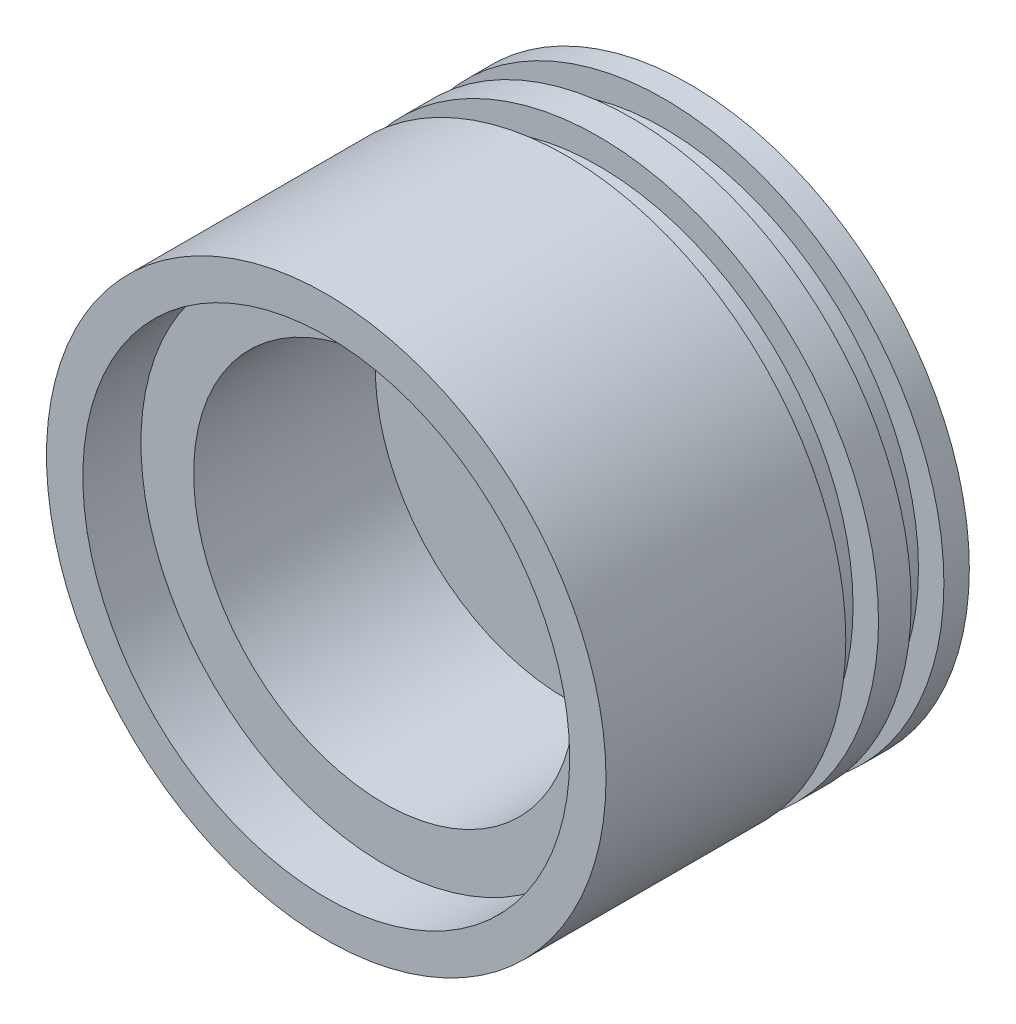
ISO-10303-21;
HEADER;
FILE_DESCRIPTION(('STEP AP214'),'2;1');
FILE_NAME('part.step','',(''),(''),'','','');
FILE_SCHEMA(('AUTOMOTIVE_DESIGN { 1 0 10303 214 1 1 1 1 }'));
ENDSEC;
DATA;
#1=APPLICATION_CONTEXT('core data for automotive mechanical design processes');
#2=APPLICATION_PROTOCOL_DEFINITION('international standard','automotive_design',2000,#1);
#3=PRODUCT_CONTEXT('',#1,'mechanical');
#4=PRODUCT('Part','Part','',(#3));
#5=PRODUCT_RELATED_PRODUCT_CATEGORY('part','',(#4));
#6=PRODUCT_DEFINITION_FORMATION('','',#4);
#7=PRODUCT_DEFINITION_CONTEXT('part definition',#1,'design');
#8=PRODUCT_DEFINITION('design','',#6,#7);
#9=PRODUCT_DEFINITION_SHAPE('','',#8);
#10=(LENGTH_UNIT() NAMED_UNIT(*) SI_UNIT(.MILLI.,.METRE.));
#11=(NAMED_UNIT(*) PLANE_ANGLE_UNIT() SI_UNIT($,.RADIAN.));
#12=(NAMED_UNIT(*) SI_UNIT($,.STERADIAN.) SOLID_ANGLE_UNIT());
#13=UNCERTAINTY_MEASURE_WITH_UNIT(LENGTH_MEASURE(1.E-05),#10,'distance_accuracy_value','');
#14=(GEOMETRIC_REPRESENTATION_CONTEXT(3) GLOBAL_UNCERTAINTY_ASSIGNED_CONTEXT((#13)) GLOBAL_UNIT_ASSIGNED_CONTEXT((#10,
#11,#12)) REPRESENTATION_CONTEXT('',''));
#15=CARTESIAN_POINT('',(0.,0.,0.));
#16=DIRECTION('',(0.,0.,1.));
#17=DIRECTION('',(1.,0.,0.));
#18=AXIS2_PLACEMENT_3D('',#15,#16,#17);
#19=CARTESIAN_POINT('',(0.,0.,-66.));
#20=DIRECTION('',(0.,0.,1.));
#21=DIRECTION('',(1.,0.,0.));
#22=AXIS2_PLACEMENT_3D('',#19,#20,#21);
#23=PLANE('',#22);
#24=CARTESIAN_POINT('',(0.,0.,-66.));
#25=DIRECTION('',(0.,0.,1.));
#26=DIRECTION('',(1.,0.,0.));
#27=AXIS2_PLACEMENT_3D('',#24,#25,#26);
#28=CIRCLE('',#27,52.5);
#29=CARTESIAN_POINT('',(52.5,0.,-66.));
#30=VERTEX_POINT('',#29);
#31=EDGE_CURVE('E77',#30,#30,#28,.T.);
#32=ORIENTED_EDGE('',*,*,#31,.T.);
#33=EDGE_LOOP('',(#32));
#34=FACE_BOUND('',#33,.T.);
#35=ADVANCED_FACE('F31',(#34),#23,.T.);
#36=CARTESIAN_POINT('',(0.,0.,191.45));
#37=DIRECTION('',(0.,0.,1.));
#38=DIRECTION('',(1.,0.,0.));
#39=AXIS2_PLACEMENT_3D('',#36,#37,#38);
#40=SPHERICAL_SURFACE('',#39,301.45);
#41=CARTESIAN_POINT('',(0.,0.,-100.));
#42=DIRECTION('',(0.,0.,1.));
#43=DIRECTION('',(1.,0.,0.));
#44=AXIS2_PLACEMENT_3D('',#41,#42,#43);
#45=CIRCLE('',#44,77.);
#46=CARTESIAN_POINT('',(77.,0.,-100.));
#47=VERTEX_POINT('',#46);
#48=EDGE_CURVE('E10',#47,#47,#45,.T.);
#49=ORIENTED_EDGE('',*,*,#48,.F.);
#50=EDGE_LOOP('',(#49));
#51=FACE_BOUND('',#50,.T.);
#52=ADVANCED_FACE('F94',(#51),#40,.T.);
#53=CARTESIAN_POINT('',(0.,0.,14.193325572744));
#54=DIRECTION('',(0.,0.,1.));
#55=DIRECTION('',(1.,0.,0.));
#56=AXIS2_PLACEMENT_3D('',#53,#54,#55);
#57=CYLINDRICAL_SURFACE('',#56,77.);
#58=ORIENTED_EDGE('',*,*,#48,.T.);
#59=EDGE_LOOP('',(#58));
#60=FACE_BOUND('',#59,.T.);
#61=CARTESIAN_POINT('',(0.,0.,-93.));
#62=DIRECTION('',(0.,0.,1.));
#63=DIRECTION('',(1.,0.,0.));
#64=AXIS2_PLACEMENT_3D('',#61,#62,#63);
#65=CIRCLE('',#64,77.);
#66=CARTESIAN_POINT('',(77.,0.,-93.));
#67=VERTEX_POINT('',#66);
#68=EDGE_CURVE('E37',#67,#67,#65,.T.);
#69=ORIENTED_EDGE('',*,*,#68,.F.);
#70=EDGE_LOOP('',(#69));
#71=FACE_BOUND('',#70,.T.);
#72=ADVANCED_FACE('F98',(#60,#71),#57,.T.);
#73=CARTESIAN_POINT('',(70.,0.,-93.));
#74=DIRECTION('',(0.,0.,1.));
#75=DIRECTION('',(1.,0.,0.));
#76=AXIS2_PLACEMENT_3D('',#73,#74,#75);
#77=PLANE('',#76);
#78=ORIENTED_EDGE('',*,*,#68,.T.);
#79=EDGE_LOOP('',(#78));
#80=FACE_BOUND('',#79,.T.);
#81=CARTESIAN_POINT('',(0.,0.,-93.));
#82=DIRECTION('',(0.,0.,1.));
#83=DIRECTION('',(1.,0.,0.));
#84=AXIS2_PLACEMENT_3D('',#81,#82,#83);
#85=CIRCLE('',#84,70.);
#86=CARTESIAN_POINT('',(70.,0.,-93.));
#87=VERTEX_POINT('',#86);
#88=EDGE_CURVE('E41',#87,#87,#85,.T.);
#89=ORIENTED_EDGE('',*,*,#88,.F.);
#90=EDGE_LOOP('',(#89));
#91=FACE_BOUND('',#90,.T.);
#92=ADVANCED_FACE('F103',(#80,#91),#77,.T.);
#93=CARTESIAN_POINT('',(0.,0.,14.193325572744));
#94=DIRECTION('',(0.,0.,1.));
#95=DIRECTION('',(1.,0.,0.));
#96=AXIS2_PLACEMENT_3D('',#93,#94,#95);
#97=CYLINDRICAL_SURFACE('',#96,70.);
#98=ORIENTED_EDGE('',*,*,#88,.T.);
#99=EDGE_LOOP('',(#98));
#100=FACE_BOUND('',#99,.T.);
#101=CARTESIAN_POINT('',(0.,0.,-84.));
#102=DIRECTION('',(0.,0.,1.));
#103=DIRECTION('',(1.,0.,0.));
#104=AXIS2_PLACEMENT_3D('',#101,#102,#103);
#105=CIRCLE('',#104,70.);
#106=CARTESIAN_POINT('',(70.,0.,-84.));
#107=VERTEX_POINT('',#106);
#108=EDGE_CURVE('E45',#107,#107,#105,.T.);
#109=ORIENTED_EDGE('',*,*,#108,.F.);
#110=EDGE_LOOP('',(#109));
#111=FACE_BOUND('',#110,.T.);
#112=ADVANCED_FACE('F108',(#100,#111),#97,.T.);
#113=CARTESIAN_POINT('',(77.,0.,-84.));
#114=DIRECTION('',(0.,0.,-1.));
#115=DIRECTION('',(-1.,0.,0.));
#116=AXIS2_PLACEMENT_3D('',#113,#114,#115);
#117=PLANE('',#116);
#118=ORIENTED_EDGE('',*,*,#108,.T.);
#119=EDGE_LOOP('',(#118));
#120=FACE_BOUND('',#119,.T.);
#121=CARTESIAN_POINT('',(0.,0.,-84.));
#122=DIRECTION('',(0.,0.,1.));
#123=DIRECTION('',(1.,0.,0.));
#124=AXIS2_PLACEMENT_3D('',#121,#122,#123);
#125=CIRCLE('',#124,77.);
#126=CARTESIAN_POINT('',(77.,0.,-84.));
#127=VERTEX_POINT('',#126);
#128=EDGE_CURVE('E50',#127,#127,#125,.T.);
#129=ORIENTED_EDGE('',*,*,#128,.F.);
#130=EDGE_LOOP('',(#129));
#131=FACE_BOUND('',#130,.T.);
#132=ADVANCED_FACE('F111',(#120,#131),#117,.T.);
#133=CARTESIAN_POINT('',(0.,0.,14.193325572744));
#134=DIRECTION('',(0.,0.,1.));
#135=DIRECTION('',(1.,0.,0.));
#136=AXIS2_PLACEMENT_3D('',#133,#134,#135);
#137=CYLINDRICAL_SURFACE('',#136,77.);
#138=ORIENTED_EDGE('',*,*,#128,.T.);
#139=EDGE_LOOP('',(#138));
#140=FACE_BOUND('',#139,.T.);
#141=CARTESIAN_POINT('',(0.,0.,-75.));
#142=DIRECTION('',(0.,0.,1.));
#143=DIRECTION('',(1.,0.,0.));
#144=AXIS2_PLACEMENT_3D('',#141,#142,#143);
#145=CIRCLE('',#144,77.);
#146=CARTESIAN_POINT('',(77.,0.,-75.));
#147=VERTEX_POINT('',#146);
#148=EDGE_CURVE('E53',#147,#147,#145,.T.);
#149=ORIENTED_EDGE('',*,*,#148,.F.);
#150=EDGE_LOOP('',(#149));
#151=FACE_BOUND('',#150,.T.);
#152=ADVANCED_FACE('F115',(#140,#151),#137,.T.);
#153=CARTESIAN_POINT('',(70.,0.,-75.));
#154=DIRECTION('',(0.,0.,1.));
#155=DIRECTION('',(1.,0.,0.));
#156=AXIS2_PLACEMENT_3D('',#153,#154,#155);
#157=PLANE('',#156);
#158=ORIENTED_EDGE('',*,*,#148,.T.);
#159=EDGE_LOOP('',(#158));
#160=FACE_BOUND('',#159,.T.);
#161=CARTESIAN_POINT('',(0.,0.,-75.));
#162=DIRECTION('',(0.,0.,1.));
#163=DIRECTION('',(1.,0.,0.));
#164=AXIS2_PLACEMENT_3D('',#161,#162,#163);
#165=CIRCLE('',#164,70.);
#166=CARTESIAN_POINT('',(70.,0.,-75.));
#167=VERTEX_POINT('',#166);
#168=EDGE_CURVE('E56',#167,#167,#165,.T.);
#169=ORIENTED_EDGE('',*,*,#168,.F.);
#170=EDGE_LOOP('',(#169));
#171=FACE_BOUND('',#170,.T.);
#172=ADVANCED_FACE('F119',(#160,#171),#157,.T.);
#173=CARTESIAN_POINT('',(0.,0.,14.193325572744));
#174=DIRECTION('',(0.,0.,1.));
#175=DIRECTION('',(1.,0.,0.));
#176=AXIS2_PLACEMENT_3D('',#173,#174,#175);
#177=CYLINDRICAL_SURFACE('',#176,70.);
#178=ORIENTED_EDGE('',*,*,#168,.T.);
#179=EDGE_LOOP('',(#178));
#180=FACE_BOUND('',#179,.T.);
#181=CARTESIAN_POINT('',(0.,0.,-66.));
#182=DIRECTION('',(0.,0.,1.));
#183=DIRECTION('',(1.,0.,0.));
#184=AXIS2_PLACEMENT_3D('',#181,#182,#183);
#185=CIRCLE('',#184,70.);
#186=CARTESIAN_POINT('',(70.,0.,-66.));
#187=VERTEX_POINT('',#186);
#188=EDGE_CURVE('E59',#187,#187,#185,.T.);
#189=ORIENTED_EDGE('',*,*,#188,.F.);
#190=EDGE_LOOP('',(#189));
#191=FACE_BOUND('',#190,.T.);
#192=ADVANCED_FACE('F123',(#180,#191),#177,.T.);
#193=CARTESIAN_POINT('',(77.,0.,-66.));
#194=DIRECTION('',(0.,0.,-1.));
#195=DIRECTION('',(-1.,0.,0.));
#196=AXIS2_PLACEMENT_3D('',#193,#194,#195);
#197=PLANE('',#196);
#198=ORIENTED_EDGE('',*,*,#188,.T.);
#199=EDGE_LOOP('',(#198));
#200=FACE_BOUND('',#199,.T.);
#201=CARTESIAN_POINT('',(0.,0.,-66.));
#202=DIRECTION('',(0.,0.,1.));
#203=DIRECTION('',(1.,0.,0.));
#204=AXIS2_PLACEMENT_3D('',#201,#202,#203);
#205=CIRCLE('',#204,77.);
#206=CARTESIAN_POINT('',(77.,0.,-66.));
#207=VERTEX_POINT('',#206);
#208=EDGE_CURVE('E62',#207,#207,#205,.T.);
#209=ORIENTED_EDGE('',*,*,#208,.F.);
#210=EDGE_LOOP('',(#209));
#211=FACE_BOUND('',#210,.T.);
#212=ADVANCED_FACE('F127',(#200,#211),#197,.T.);
#213=CARTESIAN_POINT('',(0.,0.,14.193325572744));
#214=DIRECTION('',(0.,0.,1.));
#215=DIRECTION('',(1.,0.,0.));
#216=AXIS2_PLACEMENT_3D('',#213,#214,#215);
#217=CYLINDRICAL_SURFACE('',#216,77.);
#218=ORIENTED_EDGE('',*,*,#208,.T.);
#219=EDGE_LOOP('',(#218));
#220=FACE_BOUND('',#219,.T.);
#221=CARTESIAN_POINT('',(0.,0.,0.));
#222=DIRECTION('',(0.,0.,1.));
#223=DIRECTION('',(1.,0.,0.));
#224=AXIS2_PLACEMENT_3D('',#221,#222,#223);
#225=CIRCLE('',#224,77.);
#226=CARTESIAN_POINT('',(77.,0.,0.));
#227=VERTEX_POINT('',#226);
#228=EDGE_CURVE('E65',#227,#227,#225,.T.);
#229=ORIENTED_EDGE('',*,*,#228,.F.);
#230=EDGE_LOOP('',(#229));
#231=FACE_BOUND('',#230,.T.);
#232=ADVANCED_FACE('F131',(#220,#231),#217,.T.);
#233=CARTESIAN_POINT('',(67.,0.,0.));
#234=DIRECTION('',(0.,0.,1.));
#235=DIRECTION('',(1.,0.,0.));
#236=AXIS2_PLACEMENT_3D('',#233,#234,#235);
#237=PLANE('',#236);
#238=ORIENTED_EDGE('',*,*,#228,.T.);
#239=EDGE_LOOP('',(#238));
#240=FACE_BOUND('',#239,.T.);
#241=CARTESIAN_POINT('',(0.,0.,0.));
#242=DIRECTION('',(0.,0.,1.));
#243=DIRECTION('',(1.,0.,0.));
#244=AXIS2_PLACEMENT_3D('',#241,#242,#243);
#245=CIRCLE('',#244,67.);
#246=CARTESIAN_POINT('',(67.,0.,0.));
#247=VERTEX_POINT('',#246);
#248=EDGE_CURVE('E68',#247,#247,#245,.T.);
#249=ORIENTED_EDGE('',*,*,#248,.F.);
#250=EDGE_LOOP('',(#249));
#251=FACE_BOUND('',#250,.T.);
#252=ADVANCED_FACE('F135',(#240,#251),#237,.T.);
#253=CARTESIAN_POINT('',(0.,0.,14.193325572744));
#254=DIRECTION('',(0.,0.,1.));
#255=DIRECTION('',(1.,0.,0.));
#256=AXIS2_PLACEMENT_3D('',#253,#254,#255);
#257=CYLINDRICAL_SURFACE('',#256,67.);
#258=ORIENTED_EDGE('',*,*,#248,.T.);
#259=EDGE_LOOP('',(#258));
#260=FACE_BOUND('',#259,.T.);
#261=CARTESIAN_POINT('',(0.,0.,-16.));
#262=DIRECTION('',(0.,0.,1.));
#263=DIRECTION('',(1.,0.,0.));
#264=AXIS2_PLACEMENT_3D('',#261,#262,#263);
#265=CIRCLE('',#264,67.);
#266=CARTESIAN_POINT('',(67.,0.,-16.));
#267=VERTEX_POINT('',#266);
#268=EDGE_CURVE('E71',#267,#267,#265,.T.);
#269=ORIENTED_EDGE('',*,*,#268,.F.);
#270=EDGE_LOOP('',(#269));
#271=FACE_BOUND('',#270,.T.);
#272=ADVANCED_FACE('F90',(#260,#271),#257,.F.);
#273=CARTESIAN_POINT('',(52.5,0.,-16.));
#274=DIRECTION('',(0.,0.,1.));
#275=DIRECTION('',(1.,0.,0.));
#276=AXIS2_PLACEMENT_3D('',#273,#274,#275);
#277=PLANE('',#276);
#278=ORIENTED_EDGE('',*,*,#268,.T.);
#279=EDGE_LOOP('',(#278));
#280=FACE_BOUND('',#279,.T.);
#281=CARTESIAN_POINT('',(0.,0.,-16.));
#282=DIRECTION('',(0.,0.,1.));
#283=DIRECTION('',(1.,0.,0.));
#284=AXIS2_PLACEMENT_3D('',#281,#282,#283);
#285=CIRCLE('',#284,52.5);
#286=CARTESIAN_POINT('',(52.5,0.,-16.));
#287=VERTEX_POINT('',#286);
#288=EDGE_CURVE('E74',#287,#287,#285,.T.);
#289=ORIENTED_EDGE('',*,*,#288,.F.);
#290=EDGE_LOOP('',(#289));
#291=FACE_BOUND('',#290,.T.);
#292=ADVANCED_FACE('F84',(#280,#291),#277,.T.);
#293=CARTESIAN_POINT('',(0.,0.,14.193325572744));
#294=DIRECTION('',(0.,0.,1.));
#295=DIRECTION('',(1.,0.,0.));
#296=AXIS2_PLACEMENT_3D('',#293,#294,#295);
#297=CYLINDRICAL_SURFACE('',#296,52.5);
#298=ORIENTED_EDGE('',*,*,#288,.T.);
#299=EDGE_LOOP('',(#298));
#300=FACE_BOUND('',#299,.T.);
#301=ORIENTED_EDGE('',*,*,#31,.F.);
#302=EDGE_LOOP('',(#301));
#303=FACE_BOUND('',#302,.T.);
#304=ADVANCED_FACE('F82',(#300,#303),#297,.F.);
#305=CLOSED_SHELL('',(#35,#52,#72,#92,#112,#132,#152,#172,#192,#212,#232,#252,#272,#292,#304));
#306=MANIFOLD_SOLID_BREP('B2',#305);
#307=ADVANCED_BREP_SHAPE_REPRESENTATION('',(#18,#306),#14);
#308=SHAPE_DEFINITION_REPRESENTATION(#9,#307);
ENDSEC;
END-ISO-10303-21;
